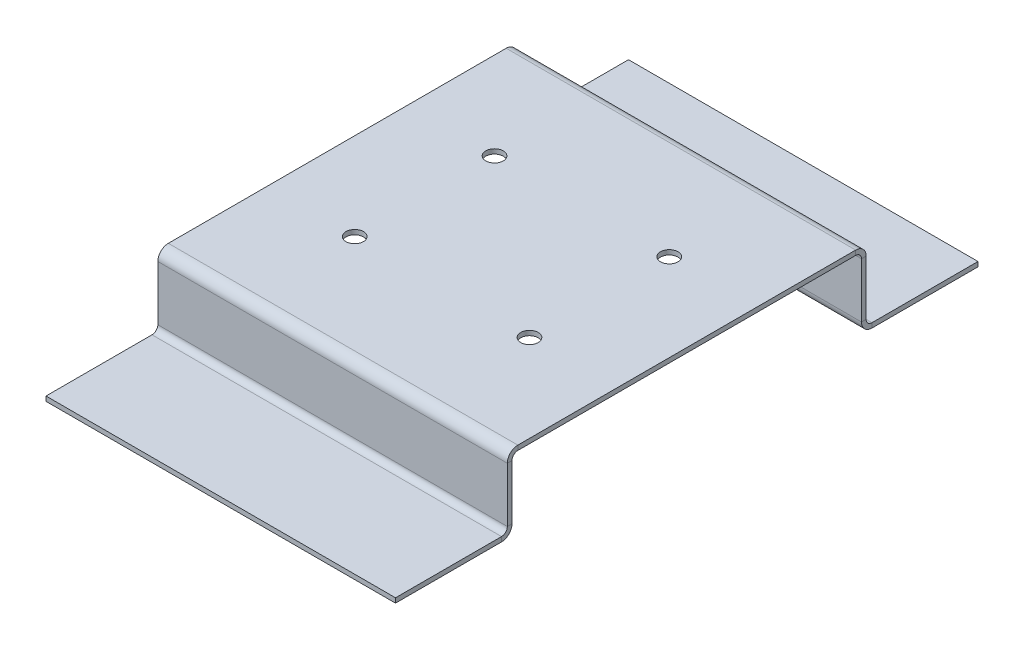
ISO-10303-21;
HEADER;
FILE_DESCRIPTION(('STEP AP214'),'2;1');
FILE_NAME('part.step','',(''),(''),'','','');
FILE_SCHEMA(('AUTOMOTIVE_DESIGN { 1 0 10303 214 1 1 1 1 }'));
ENDSEC;
DATA;
#1=APPLICATION_CONTEXT('core data for automotive mechanical design processes');
#2=APPLICATION_PROTOCOL_DEFINITION('international standard','automotive_design',2000,#1);
#3=PRODUCT_CONTEXT('',#1,'mechanical');
#4=PRODUCT('Part','Part','',(#3));
#5=PRODUCT_RELATED_PRODUCT_CATEGORY('part','',(#4));
#6=PRODUCT_DEFINITION_FORMATION('','',#4);
#7=PRODUCT_DEFINITION_CONTEXT('part definition',#1,'design');
#8=PRODUCT_DEFINITION('design','',#6,#7);
#9=PRODUCT_DEFINITION_SHAPE('','',#8);
#10=(LENGTH_UNIT() NAMED_UNIT(*) SI_UNIT(.MILLI.,.METRE.));
#11=(NAMED_UNIT(*) PLANE_ANGLE_UNIT() SI_UNIT($,.RADIAN.));
#12=(NAMED_UNIT(*) SI_UNIT($,.STERADIAN.) SOLID_ANGLE_UNIT());
#13=UNCERTAINTY_MEASURE_WITH_UNIT(LENGTH_MEASURE(1.E-05),#10,'distance_accuracy_value','');
#14=(GEOMETRIC_REPRESENTATION_CONTEXT(3) GLOBAL_UNCERTAINTY_ASSIGNED_CONTEXT((#13)) GLOBAL_UNIT_ASSIGNED_CONTEXT((#10,
#11,#12)) REPRESENTATION_CONTEXT('',''));
#15=CARTESIAN_POINT('',(0.,0.,0.));
#16=DIRECTION('',(0.,0.,1.));
#17=DIRECTION('',(1.,0.,0.));
#18=AXIS2_PLACEMENT_3D('',#15,#16,#17);
#19=CARTESIAN_POINT('',(-30.,-13.,-30.8));
#20=DIRECTION('',(-1.,0.,0.));
#21=DIRECTION('',(0.,-1.,0.));
#22=AXIS2_PLACEMENT_3D('',#19,#20,#21);
#23=PLANE('',#22);
#24=DIRECTION('',(0.,-1.,0.));
#25=VECTOR('',#24,1.);
#26=CARTESIAN_POINT('',(-30.,-13.,-30.8));
#27=LINE('',#26,#25);
#28=CARTESIAN_POINT('',(-30.,-1.8,-30.8));
#29=VERTEX_POINT('',#28);
#30=CARTESIAN_POINT('',(-30.,-11.2,-30.8));
#31=VERTEX_POINT('',#30);
#32=EDGE_CURVE('E389',#29,#31,#27,.T.);
#33=ORIENTED_EDGE('',*,*,#32,.T.);
#34=DIRECTION('',(0.,0.,1.));
#35=VECTOR('',#34,1.);
#36=CARTESIAN_POINT('',(-30.,-11.2,-30.8));
#37=LINE('',#36,#35);
#38=CARTESIAN_POINT('',(-30.,-11.2,-30.));
#39=VERTEX_POINT('',#38);
#40=EDGE_CURVE('E267',#31,#39,#37,.T.);
#41=ORIENTED_EDGE('',*,*,#40,.T.);
#42=DIRECTION('',(0.,-1.,0.));
#43=VECTOR('',#42,1.);
#44=CARTESIAN_POINT('',(-30.,-13.,-30.));
#45=LINE('',#44,#43);
#46=CARTESIAN_POINT('',(-30.,-1.8,-30.));
#47=VERTEX_POINT('',#46);
#48=EDGE_CURVE('E388',#47,#39,#45,.T.);
#49=ORIENTED_EDGE('',*,*,#48,.F.);
#50=DIRECTION('',(0.,0.,-1.));
#51=VECTOR('',#50,1.);
#52=CARTESIAN_POINT('',(-30.,-1.8,-30.));
#53=LINE('',#52,#51);
#54=EDGE_CURVE('E374',#47,#29,#53,.T.);
#55=ORIENTED_EDGE('',*,*,#54,.T.);
#56=EDGE_LOOP('',(#33,#41,#49,#55));
#57=FACE_BOUND('',#56,.T.);
#58=ADVANCED_FACE('F77',(#57),#23,.T.);
#59=CARTESIAN_POINT('',(0.,1.05170308243476E-13,-30.8));
#60=DIRECTION('',(0.,0.,-1.));
#61=DIRECTION('',(0.,1.,0.));
#62=AXIS2_PLACEMENT_3D('',#59,#60,#61);
#63=PLANE('',#62);
#64=DIRECTION('',(0.,1.,0.));
#65=VECTOR('',#64,1.);
#66=CARTESIAN_POINT('',(30.,-0.799999999999997,-30.8));
#67=LINE('',#66,#65);
#68=CARTESIAN_POINT('',(30.,-11.2,-30.8));
#69=VERTEX_POINT('',#68);
#70=CARTESIAN_POINT('',(30.,-1.79999999999999,-30.8));
#71=VERTEX_POINT('',#70);
#72=EDGE_CURVE('E391',#69,#71,#67,.T.);
#73=ORIENTED_EDGE('',*,*,#72,.F.);
#74=DIRECTION('',(-1.,0.,0.));
#75=VECTOR('',#74,1.);
#76=CARTESIAN_POINT('',(-30.,-11.2,-30.8));
#77=LINE('',#76,#75);
#78=EDGE_CURVE('E101',#31,#69,#77,.F.);
#79=ORIENTED_EDGE('',*,*,#78,.F.);
#80=ORIENTED_EDGE('',*,*,#32,.F.);
#81=DIRECTION('',(1.,0.,0.));
#82=VECTOR('',#81,1.);
#83=CARTESIAN_POINT('',(0.,-1.79999999999999,-30.8));
#84=LINE('',#83,#82);
#85=EDGE_CURVE('E383',#29,#71,#84,.T.);
#86=ORIENTED_EDGE('',*,*,#85,.T.);
#87=EDGE_LOOP('',(#73,#79,#80,#86));
#88=FACE_BOUND('',#87,.T.);
#89=ADVANCED_FACE('F510',(#88),#63,.T.);
#90=CARTESIAN_POINT('',(0.,1.02377123172402E-13,-30.));
#91=DIRECTION('',(0.,0.,-1.));
#92=DIRECTION('',(0.,1.,0.));
#93=AXIS2_PLACEMENT_3D('',#90,#91,#92);
#94=PLANE('',#93);
#95=DIRECTION('',(-1.,0.,0.));
#96=VECTOR('',#95,1.);
#97=CARTESIAN_POINT('',(-30.,-11.2,-30.));
#98=LINE('',#97,#96);
#99=CARTESIAN_POINT('',(30.,-11.2,-30.));
#100=VERTEX_POINT('',#99);
#101=EDGE_CURVE('E261',#39,#100,#98,.F.);
#102=ORIENTED_EDGE('',*,*,#101,.T.);
#103=DIRECTION('',(0.,1.,0.));
#104=VECTOR('',#103,1.);
#105=CARTESIAN_POINT('',(30.,-0.8,-30.));
#106=LINE('',#105,#104);
#107=CARTESIAN_POINT('',(30.,-1.8,-30.));
#108=VERTEX_POINT('',#107);
#109=EDGE_CURVE('E392',#100,#108,#106,.T.);
#110=ORIENTED_EDGE('',*,*,#109,.T.);
#111=DIRECTION('',(1.,0.,0.));
#112=VECTOR('',#111,1.);
#113=CARTESIAN_POINT('',(-30.,-1.8,-30.));
#114=LINE('',#113,#112);
#115=EDGE_CURVE('E377',#47,#108,#114,.T.);
#116=ORIENTED_EDGE('',*,*,#115,.F.);
#117=ORIENTED_EDGE('',*,*,#48,.T.);
#118=EDGE_LOOP('',(#102,#110,#116,#117));
#119=FACE_BOUND('',#118,.T.);
#120=ADVANCED_FACE('F475',(#119),#94,.F.);
#121=CARTESIAN_POINT('',(30.,-0.799999999999997,30.8));
#122=DIRECTION('',(1.,0.,0.));
#123=DIRECTION('',(0.,0.,-1.));
#124=AXIS2_PLACEMENT_3D('',#121,#122,#123);
#125=PLANE('',#124);
#126=DIRECTION('',(0.,-1.,0.));
#127=VECTOR('',#126,1.);
#128=CARTESIAN_POINT('',(30.,-0.799999999999997,30.8));
#129=LINE('',#128,#127);
#130=CARTESIAN_POINT('',(30.,-1.79999999999999,30.8));
#131=VERTEX_POINT('',#130);
#132=CARTESIAN_POINT('',(30.,-11.2,30.8));
#133=VERTEX_POINT('',#132);
#134=EDGE_CURVE('E344',#131,#133,#129,.T.);
#135=ORIENTED_EDGE('',*,*,#134,.T.);
#136=DIRECTION('',(0.,0.,-1.));
#137=VECTOR('',#136,1.);
#138=CARTESIAN_POINT('',(30.,-11.2,30.8));
#139=LINE('',#138,#137);
#140=CARTESIAN_POINT('',(30.,-11.2,30.));
#141=VERTEX_POINT('',#140);
#142=EDGE_CURVE('E317',#133,#141,#139,.T.);
#143=ORIENTED_EDGE('',*,*,#142,.T.);
#144=DIRECTION('',(0.,-1.,0.));
#145=VECTOR('',#144,1.);
#146=CARTESIAN_POINT('',(30.,-0.8,30.));
#147=LINE('',#146,#145);
#148=CARTESIAN_POINT('',(30.,-1.79999999999999,30.));
#149=VERTEX_POINT('',#148);
#150=EDGE_CURVE('E343',#149,#141,#147,.T.);
#151=ORIENTED_EDGE('',*,*,#150,.F.);
#152=DIRECTION('',(0.,0.,1.));
#153=VECTOR('',#152,1.);
#154=CARTESIAN_POINT('',(30.,-1.8,30.));
#155=LINE('',#154,#153);
#156=EDGE_CURVE('E330',#149,#131,#155,.T.);
#157=ORIENTED_EDGE('',*,*,#156,.T.);
#158=EDGE_LOOP('',(#135,#143,#151,#157));
#159=FACE_BOUND('',#158,.T.);
#160=ADVANCED_FACE('F452',(#159),#125,.T.);
#161=CARTESIAN_POINT('',(0.,1.05170308243476E-13,30.8));
#162=DIRECTION('',(0.,0.,-1.));
#163=DIRECTION('',(0.,1.,0.));
#164=AXIS2_PLACEMENT_3D('',#161,#162,#163);
#165=PLANE('',#164);
#166=DIRECTION('',(1.,0.,0.));
#167=VECTOR('',#166,1.);
#168=CARTESIAN_POINT('',(30.,-11.2,30.8));
#169=LINE('',#168,#167);
#170=CARTESIAN_POINT('',(-30.,-11.2,30.8));
#171=VERTEX_POINT('',#170);
#172=EDGE_CURVE('E323',#133,#171,#169,.F.);
#173=ORIENTED_EDGE('',*,*,#172,.F.);
#174=ORIENTED_EDGE('',*,*,#134,.F.);
#175=DIRECTION('',(1.,0.,0.));
#176=VECTOR('',#175,1.);
#177=CARTESIAN_POINT('',(0.,-1.8,30.8));
#178=LINE('',#177,#176);
#179=CARTESIAN_POINT('',(-30.,-1.8,30.8));
#180=VERTEX_POINT('',#179);
#181=EDGE_CURVE('E339',#180,#131,#178,.T.);
#182=ORIENTED_EDGE('',*,*,#181,.F.);
#183=DIRECTION('',(0.,1.,0.));
#184=VECTOR('',#183,1.);
#185=CARTESIAN_POINT('',(-30.,-13.,30.8));
#186=LINE('',#185,#184);
#187=EDGE_CURVE('E347',#171,#180,#186,.T.);
#188=ORIENTED_EDGE('',*,*,#187,.F.);
#189=EDGE_LOOP('',(#173,#174,#182,#188));
#190=FACE_BOUND('',#189,.T.);
#191=ADVANCED_FACE('F446',(#190),#165,.F.);
#192=CARTESIAN_POINT('',(0.,1.02377123172402E-13,30.));
#193=DIRECTION('',(0.,0.,-1.));
#194=DIRECTION('',(0.,1.,0.));
#195=AXIS2_PLACEMENT_3D('',#192,#193,#194);
#196=PLANE('',#195);
#197=ORIENTED_EDGE('',*,*,#150,.T.);
#198=DIRECTION('',(1.,0.,0.));
#199=VECTOR('',#198,1.);
#200=CARTESIAN_POINT('',(30.,-11.2,30.));
#201=LINE('',#200,#199);
#202=CARTESIAN_POINT('',(-30.,-11.2,30.));
#203=VERTEX_POINT('',#202);
#204=EDGE_CURVE('E310',#141,#203,#201,.F.);
#205=ORIENTED_EDGE('',*,*,#204,.T.);
#206=DIRECTION('',(0.,1.,0.));
#207=VECTOR('',#206,1.);
#208=CARTESIAN_POINT('',(-30.,-13.,30.));
#209=LINE('',#208,#207);
#210=CARTESIAN_POINT('',(-30.,-1.79999999999999,30.));
#211=VERTEX_POINT('',#210);
#212=EDGE_CURVE('E348',#203,#211,#209,.T.);
#213=ORIENTED_EDGE('',*,*,#212,.T.);
#214=DIRECTION('',(-1.,0.,0.));
#215=VECTOR('',#214,1.);
#216=CARTESIAN_POINT('',(30.,-1.8,30.));
#217=LINE('',#216,#215);
#218=EDGE_CURVE('E333',#149,#211,#217,.T.);
#219=ORIENTED_EDGE('',*,*,#218,.F.);
#220=EDGE_LOOP('',(#197,#205,#213,#219));
#221=FACE_BOUND('',#220,.T.);
#222=ADVANCED_FACE('F455',(#221),#196,.T.);
#223=CARTESIAN_POINT('',(0.,-0.8,0.));
#224=DIRECTION('',(0.,-1.,0.));
#225=DIRECTION('',(0.,0.,-1.));
#226=AXIS2_PLACEMENT_3D('',#223,#224,#225);
#227=PLANE('',#226);
#228=CARTESIAN_POINT('',(-15.,-0.8,12.));
#229=DIRECTION('',(0.,-1.,0.));
#230=DIRECTION('',(0.,0.,-1.));
#231=AXIS2_PLACEMENT_3D('',#228,#229,#230);
#232=CIRCLE('',#231,1.5);
#233=CARTESIAN_POINT('',(-15.,-0.8,10.5));
#234=VERTEX_POINT('',#233);
#235=EDGE_CURVE('E260',#234,#234,#232,.T.);
#236=ORIENTED_EDGE('',*,*,#235,.F.);
#237=EDGE_LOOP('',(#236));
#238=FACE_BOUND('',#237,.T.);
#239=CARTESIAN_POINT('',(15.,-0.8,12.));
#240=DIRECTION('',(0.,-1.,0.));
#241=DIRECTION('',(0.,0.,-1.));
#242=AXIS2_PLACEMENT_3D('',#239,#240,#241);
#243=CIRCLE('',#242,1.5);
#244=CARTESIAN_POINT('',(15.,-0.8,10.5));
#245=VERTEX_POINT('',#244);
#246=EDGE_CURVE('E972',#245,#245,#243,.T.);
#247=ORIENTED_EDGE('',*,*,#246,.F.);
#248=EDGE_LOOP('',(#247));
#249=FACE_BOUND('',#248,.T.);
#250=CARTESIAN_POINT('',(15.,-0.8,-12.));
#251=DIRECTION('',(0.,-1.,0.));
#252=DIRECTION('',(0.,0.,-1.));
#253=AXIS2_PLACEMENT_3D('',#250,#251,#252);
#254=CIRCLE('',#253,1.5);
#255=CARTESIAN_POINT('',(15.,-0.8,-13.5));
#256=VERTEX_POINT('',#255);
#257=EDGE_CURVE('E969',#256,#256,#254,.T.);
#258=ORIENTED_EDGE('',*,*,#257,.F.);
#259=EDGE_LOOP('',(#258));
#260=FACE_BOUND('',#259,.T.);
#261=CARTESIAN_POINT('',(-15.,-0.8,-12.));
#262=DIRECTION('',(0.,-1.,0.));
#263=DIRECTION('',(0.,0.,-1.));
#264=AXIS2_PLACEMENT_3D('',#261,#262,#263);
#265=CIRCLE('',#264,1.5);
#266=CARTESIAN_POINT('',(-15.,-0.8,-13.5));
#267=VERTEX_POINT('',#266);
#268=EDGE_CURVE('E966',#267,#267,#265,.T.);
#269=ORIENTED_EDGE('',*,*,#268,.F.);
#270=EDGE_LOOP('',(#269));
#271=FACE_BOUND('',#270,.T.);
#272=DIRECTION('',(0.,0.,-1.));
#273=VECTOR('',#272,1.);
#274=CARTESIAN_POINT('',(30.,-0.8,30.));
#275=LINE('',#274,#273);
#276=CARTESIAN_POINT('',(30.,-0.799999999999995,29.));
#277=VERTEX_POINT('',#276);
#278=CARTESIAN_POINT('',(30.,-0.8,-29.));
#279=VERTEX_POINT('',#278);
#280=EDGE_CURVE('E86',#277,#279,#275,.T.);
#281=ORIENTED_EDGE('',*,*,#280,.F.);
#282=DIRECTION('',(-1.,0.,0.));
#283=VECTOR('',#282,1.);
#284=CARTESIAN_POINT('',(-30.,-0.799999999999995,29.));
#285=LINE('',#284,#283);
#286=CARTESIAN_POINT('',(-30.,-0.799999999999995,29.));
#287=VERTEX_POINT('',#286);
#288=EDGE_CURVE('E366',#287,#277,#285,.F.);
#289=ORIENTED_EDGE('',*,*,#288,.F.);
#290=DIRECTION('',(0.,0.,1.));
#291=VECTOR('',#290,1.);
#292=CARTESIAN_POINT('',(-30.,-0.8,30.));
#293=LINE('',#292,#291);
#294=CARTESIAN_POINT('',(-30.,-0.8,-29.));
#295=VERTEX_POINT('',#294);
#296=EDGE_CURVE('E13',#295,#287,#293,.T.);
#297=ORIENTED_EDGE('',*,*,#296,.F.);
#298=DIRECTION('',(1.,0.,0.));
#299=VECTOR('',#298,1.);
#300=CARTESIAN_POINT('',(30.,-0.800000000000002,-29.));
#301=LINE('',#300,#299);
#302=EDGE_CURVE('E410',#279,#295,#301,.F.);
#303=ORIENTED_EDGE('',*,*,#302,.F.);
#304=EDGE_LOOP('',(#281,#289,#297,#303));
#305=FACE_BOUND('',#304,.T.);
#306=ADVANCED_FACE('F460',(#238,#249,#260,#271,#305),#227,.T.);
#307=CARTESIAN_POINT('',(0.,0.,0.));
#308=DIRECTION('',(0.,-1.,0.));
#309=DIRECTION('',(0.,0.,-1.));
#310=AXIS2_PLACEMENT_3D('',#307,#308,#309);
#311=PLANE('',#310);
#312=CARTESIAN_POINT('',(-15.,0.,12.));
#313=DIRECTION('',(0.,1.,0.));
#314=DIRECTION('',(0.,0.,1.));
#315=AXIS2_PLACEMENT_3D('',#312,#313,#314);
#316=CIRCLE('',#315,1.5);
#317=CARTESIAN_POINT('',(-15.,0.,13.5));
#318=VERTEX_POINT('',#317);
#319=EDGE_CURVE('E955',#318,#318,#316,.T.);
#320=ORIENTED_EDGE('',*,*,#319,.F.);
#321=EDGE_LOOP('',(#320));
#322=FACE_BOUND('',#321,.T.);
#323=CARTESIAN_POINT('',(15.,0.,12.));
#324=DIRECTION('',(0.,1.,0.));
#325=DIRECTION('',(0.,0.,1.));
#326=AXIS2_PLACEMENT_3D('',#323,#324,#325);
#327=CIRCLE('',#326,1.5);
#328=CARTESIAN_POINT('',(15.,0.,13.5));
#329=VERTEX_POINT('',#328);
#330=EDGE_CURVE('E956',#329,#329,#327,.T.);
#331=ORIENTED_EDGE('',*,*,#330,.F.);
#332=EDGE_LOOP('',(#331));
#333=FACE_BOUND('',#332,.T.);
#334=CARTESIAN_POINT('',(15.,0.,-12.));
#335=DIRECTION('',(0.,1.,0.));
#336=DIRECTION('',(0.,0.,1.));
#337=AXIS2_PLACEMENT_3D('',#334,#335,#336);
#338=CIRCLE('',#337,1.5);
#339=CARTESIAN_POINT('',(15.,0.,-10.5));
#340=VERTEX_POINT('',#339);
#341=EDGE_CURVE('E959',#340,#340,#338,.T.);
#342=ORIENTED_EDGE('',*,*,#341,.F.);
#343=EDGE_LOOP('',(#342));
#344=FACE_BOUND('',#343,.T.);
#345=CARTESIAN_POINT('',(-15.,0.,-12.));
#346=DIRECTION('',(0.,1.,0.));
#347=DIRECTION('',(0.,0.,1.));
#348=AXIS2_PLACEMENT_3D('',#345,#346,#347);
#349=CIRCLE('',#348,1.5);
#350=CARTESIAN_POINT('',(-15.,0.,-10.5));
#351=VERTEX_POINT('',#350);
#352=EDGE_CURVE('E963',#351,#351,#349,.T.);
#353=ORIENTED_EDGE('',*,*,#352,.F.);
#354=EDGE_LOOP('',(#353));
#355=FACE_BOUND('',#354,.T.);
#356=DIRECTION('',(-1.,0.,0.));
#357=VECTOR('',#356,1.);
#358=CARTESIAN_POINT('',(-30.,0.,29.));
#359=LINE('',#358,#357);
#360=CARTESIAN_POINT('',(-30.,0.,29.));
#361=VERTEX_POINT('',#360);
#362=CARTESIAN_POINT('',(30.,0.,29.));
#363=VERTEX_POINT('',#362);
#364=EDGE_CURVE('E354',#361,#363,#359,.F.);
#365=ORIENTED_EDGE('',*,*,#364,.T.);
#366=DIRECTION('',(0.,0.,-1.));
#367=VECTOR('',#366,1.);
#368=CARTESIAN_POINT('',(30.,0.,30.));
#369=LINE('',#368,#367);
#370=CARTESIAN_POINT('',(30.,0.,-29.));
#371=VERTEX_POINT('',#370);
#372=EDGE_CURVE('E418',#363,#371,#369,.T.);
#373=ORIENTED_EDGE('',*,*,#372,.T.);
#374=DIRECTION('',(1.,0.,0.));
#375=VECTOR('',#374,1.);
#376=CARTESIAN_POINT('',(30.,0.,-29.));
#377=LINE('',#376,#375);
#378=CARTESIAN_POINT('',(-30.,0.,-29.));
#379=VERTEX_POINT('',#378);
#380=EDGE_CURVE('E398',#371,#379,#377,.F.);
#381=ORIENTED_EDGE('',*,*,#380,.T.);
#382=DIRECTION('',(0.,0.,1.));
#383=VECTOR('',#382,1.);
#384=CARTESIAN_POINT('',(-30.,0.,30.));
#385=LINE('',#384,#383);
#386=EDGE_CURVE('E81',#379,#361,#385,.T.);
#387=ORIENTED_EDGE('',*,*,#386,.T.);
#388=EDGE_LOOP('',(#365,#373,#381,#387));
#389=FACE_BOUND('',#388,.T.);
#390=ADVANCED_FACE('F425',(#322,#333,#344,#355,#389),#311,.F.);
#391=CARTESIAN_POINT('',(-30.,-0.8,30.));
#392=DIRECTION('',(-1.,0.,0.));
#393=DIRECTION('',(0.,0.,1.));
#394=AXIS2_PLACEMENT_3D('',#391,#392,#393);
#395=PLANE('',#394);
#396=ORIENTED_EDGE('',*,*,#296,.T.);
#397=DIRECTION('',(0.,1.,0.));
#398=VECTOR('',#397,1.);
#399=CARTESIAN_POINT('',(-30.,-0.799999999999995,29.));
#400=LINE('',#399,#398);
#401=EDGE_CURVE('E360',#287,#361,#400,.T.);
#402=ORIENTED_EDGE('',*,*,#401,.T.);
#403=ORIENTED_EDGE('',*,*,#386,.F.);
#404=DIRECTION('',(0.,1.,0.));
#405=VECTOR('',#404,1.);
#406=CARTESIAN_POINT('',(-30.,-0.800000000000002,-29.));
#407=LINE('',#406,#405);
#408=EDGE_CURVE('E415',#295,#379,#407,.T.);
#409=ORIENTED_EDGE('',*,*,#408,.F.);
#410=EDGE_LOOP('',(#396,#402,#403,#409));
#411=FACE_BOUND('',#410,.T.);
#412=ADVANCED_FACE('F429',(#411),#395,.T.);
#413=CARTESIAN_POINT('',(30.,-0.8,30.));
#414=DIRECTION('',(1.,0.,0.));
#415=DIRECTION('',(0.,0.,-1.));
#416=AXIS2_PLACEMENT_3D('',#413,#414,#415);
#417=PLANE('',#416);
#418=DIRECTION('',(0.,1.,0.));
#419=VECTOR('',#418,1.);
#420=CARTESIAN_POINT('',(30.,-0.799999999999995,29.));
#421=LINE('',#420,#419);
#422=EDGE_CURVE('E371',#277,#363,#421,.T.);
#423=ORIENTED_EDGE('',*,*,#422,.F.);
#424=ORIENTED_EDGE('',*,*,#280,.T.);
#425=DIRECTION('',(0.,1.,0.));
#426=VECTOR('',#425,1.);
#427=CARTESIAN_POINT('',(30.,-0.800000000000002,-29.));
#428=LINE('',#427,#426);
#429=EDGE_CURVE('E404',#279,#371,#428,.T.);
#430=ORIENTED_EDGE('',*,*,#429,.T.);
#431=ORIENTED_EDGE('',*,*,#372,.F.);
#432=EDGE_LOOP('',(#423,#424,#430,#431));
#433=FACE_BOUND('',#432,.T.);
#434=ADVANCED_FACE('F79',(#433),#417,.T.);
#435=CARTESIAN_POINT('',(-30.,-1.8,-29.));
#436=DIRECTION('',(-1.,0.,0.));
#437=DIRECTION('',(0.,0.,1.));
#438=AXIS2_PLACEMENT_3D('',#435,#436,#437);
#439=PLANE('',#438);
#440=ORIENTED_EDGE('',*,*,#54,.F.);
#441=CARTESIAN_POINT('',(-30.,-1.8,-29.));
#442=DIRECTION('',(1.,0.,0.));
#443=DIRECTION('',(0.,0.,-1.));
#444=AXIS2_PLACEMENT_3D('',#441,#442,#443);
#445=CIRCLE('',#444,1.);
#446=EDGE_CURVE('E407',#295,#47,#445,.F.);
#447=ORIENTED_EDGE('',*,*,#446,.F.);
#448=ORIENTED_EDGE('',*,*,#408,.T.);
#449=CARTESIAN_POINT('',(-30.,-1.8,-29.));
#450=DIRECTION('',(1.,0.,0.));
#451=DIRECTION('',(0.,0.,-1.));
#452=AXIS2_PLACEMENT_3D('',#449,#450,#451);
#453=CIRCLE('',#452,1.8);
#454=EDGE_CURVE('E400',#379,#29,#453,.F.);
#455=ORIENTED_EDGE('',*,*,#454,.T.);
#456=EDGE_LOOP('',(#440,#447,#448,#455));
#457=FACE_BOUND('',#456,.T.);
#458=ADVANCED_FACE('F526',(#457),#439,.T.);
#459=CARTESIAN_POINT('',(30.,-1.8,-29.));
#460=DIRECTION('',(-1.,0.,0.));
#461=DIRECTION('',(0.,0.,1.));
#462=AXIS2_PLACEMENT_3D('',#459,#460,#461);
#463=PLANE('',#462);
#464=CARTESIAN_POINT('',(30.,-1.8,-29.));
#465=DIRECTION('',(1.,0.,0.));
#466=DIRECTION('',(0.,0.,-1.));
#467=AXIS2_PLACEMENT_3D('',#464,#465,#466);
#468=CIRCLE('',#467,1.);
#469=EDGE_CURVE('E394',#108,#279,#468,.T.);
#470=ORIENTED_EDGE('',*,*,#469,.F.);
#471=DIRECTION('',(0.,0.,-1.));
#472=VECTOR('',#471,1.);
#473=CARTESIAN_POINT('',(30.,-1.8,-30.));
#474=LINE('',#473,#472);
#475=EDGE_CURVE('E380',#108,#71,#474,.T.);
#476=ORIENTED_EDGE('',*,*,#475,.T.);
#477=CARTESIAN_POINT('',(30.,-1.8,-29.));
#478=DIRECTION('',(1.,0.,0.));
#479=DIRECTION('',(0.,0.,-1.));
#480=AXIS2_PLACEMENT_3D('',#477,#478,#479);
#481=CIRCLE('',#480,1.8);
#482=EDGE_CURVE('E401',#71,#371,#481,.T.);
#483=ORIENTED_EDGE('',*,*,#482,.T.);
#484=ORIENTED_EDGE('',*,*,#429,.F.);
#485=EDGE_LOOP('',(#470,#476,#483,#484));
#486=FACE_BOUND('',#485,.T.);
#487=ADVANCED_FACE('F466',(#486),#463,.F.);
#488=CARTESIAN_POINT('',(30.,-1.8,-29.));
#489=DIRECTION('',(1.,0.,0.));
#490=DIRECTION('',(0.,0.,-1.));
#491=AXIS2_PLACEMENT_3D('',#488,#489,#490);
#492=CYLINDRICAL_SURFACE('',#491,1.8);
#493=ORIENTED_EDGE('',*,*,#380,.F.);
#494=ORIENTED_EDGE('',*,*,#482,.F.);
#495=ORIENTED_EDGE('',*,*,#85,.F.);
#496=ORIENTED_EDGE('',*,*,#454,.F.);
#497=EDGE_LOOP('',(#493,#494,#495,#496));
#498=FACE_BOUND('',#497,.T.);
#499=ADVANCED_FACE('F520',(#498),#492,.T.);
#500=CARTESIAN_POINT('',(30.,-1.8,-29.));
#501=DIRECTION('',(1.,0.,0.));
#502=DIRECTION('',(0.,0.,-1.));
#503=AXIS2_PLACEMENT_3D('',#500,#501,#502);
#504=CYLINDRICAL_SURFACE('',#503,1.);
#505=ORIENTED_EDGE('',*,*,#302,.T.);
#506=ORIENTED_EDGE('',*,*,#446,.T.);
#507=ORIENTED_EDGE('',*,*,#115,.T.);
#508=ORIENTED_EDGE('',*,*,#469,.T.);
#509=EDGE_LOOP('',(#505,#506,#507,#508));
#510=FACE_BOUND('',#509,.T.);
#511=ADVANCED_FACE('F470',(#510),#504,.F.);
#512=CARTESIAN_POINT('',(30.,-0.799999999999997,-30.8));
#513=DIRECTION('',(1.,0.,0.));
#514=DIRECTION('',(0.,1.,0.));
#515=AXIS2_PLACEMENT_3D('',#512,#513,#514);
#516=PLANE('',#515);
#517=DIRECTION('',(0.,0.,1.));
#518=VECTOR('',#517,1.);
#519=CARTESIAN_POINT('',(30.,-11.2,-30.8));
#520=LINE('',#519,#518);
#521=EDGE_CURVE('E94',#69,#100,#520,.T.);
#522=ORIENTED_EDGE('',*,*,#521,.F.);
#523=ORIENTED_EDGE('',*,*,#72,.T.);
#524=ORIENTED_EDGE('',*,*,#475,.F.);
#525=ORIENTED_EDGE('',*,*,#109,.F.);
#526=EDGE_LOOP('',(#522,#523,#524,#525));
#527=FACE_BOUND('',#526,.T.);
#528=ADVANCED_FACE('F518',(#527),#516,.T.);
#529=CARTESIAN_POINT('',(30.,-1.8,29.));
#530=DIRECTION('',(1.,0.,0.));
#531=DIRECTION('',(0.,0.,-1.));
#532=AXIS2_PLACEMENT_3D('',#529,#530,#531);
#533=PLANE('',#532);
#534=ORIENTED_EDGE('',*,*,#156,.F.);
#535=CARTESIAN_POINT('',(30.,-1.8,29.));
#536=DIRECTION('',(-1.,0.,0.));
#537=DIRECTION('',(0.,0.,1.));
#538=AXIS2_PLACEMENT_3D('',#535,#536,#537);
#539=CIRCLE('',#538,1.);
#540=EDGE_CURVE('E363',#277,#149,#539,.F.);
#541=ORIENTED_EDGE('',*,*,#540,.F.);
#542=ORIENTED_EDGE('',*,*,#422,.T.);
#543=CARTESIAN_POINT('',(30.,-1.8,29.));
#544=DIRECTION('',(-1.,0.,0.));
#545=DIRECTION('',(0.,0.,1.));
#546=AXIS2_PLACEMENT_3D('',#543,#544,#545);
#547=CIRCLE('',#546,1.8);
#548=EDGE_CURVE('E356',#363,#131,#547,.F.);
#549=ORIENTED_EDGE('',*,*,#548,.T.);
#550=EDGE_LOOP('',(#534,#541,#542,#549));
#551=FACE_BOUND('',#550,.T.);
#552=ADVANCED_FACE('F448',(#551),#533,.T.);
#553=CARTESIAN_POINT('',(-30.,-1.8,29.));
#554=DIRECTION('',(1.,0.,0.));
#555=DIRECTION('',(0.,0.,-1.));
#556=AXIS2_PLACEMENT_3D('',#553,#554,#555);
#557=PLANE('',#556);
#558=CARTESIAN_POINT('',(-30.,-1.8,29.));
#559=DIRECTION('',(-1.,0.,0.));
#560=DIRECTION('',(0.,0.,1.));
#561=AXIS2_PLACEMENT_3D('',#558,#559,#560);
#562=CIRCLE('',#561,1.);
#563=EDGE_CURVE('E350',#211,#287,#562,.T.);
#564=ORIENTED_EDGE('',*,*,#563,.F.);
#565=DIRECTION('',(0.,0.,1.));
#566=VECTOR('',#565,1.);
#567=CARTESIAN_POINT('',(-30.,-1.8,30.));
#568=LINE('',#567,#566);
#569=EDGE_CURVE('E336',#211,#180,#568,.T.);
#570=ORIENTED_EDGE('',*,*,#569,.T.);
#571=CARTESIAN_POINT('',(-30.,-1.8,29.));
#572=DIRECTION('',(-1.,0.,0.));
#573=DIRECTION('',(0.,0.,1.));
#574=AXIS2_PLACEMENT_3D('',#571,#572,#573);
#575=CIRCLE('',#574,1.8);
#576=EDGE_CURVE('E357',#180,#361,#575,.T.);
#577=ORIENTED_EDGE('',*,*,#576,.T.);
#578=ORIENTED_EDGE('',*,*,#401,.F.);
#579=EDGE_LOOP('',(#564,#570,#577,#578));
#580=FACE_BOUND('',#579,.T.);
#581=ADVANCED_FACE('F437',(#580),#557,.F.);
#582=CARTESIAN_POINT('',(-30.,-1.8,29.));
#583=DIRECTION('',(-1.,0.,0.));
#584=DIRECTION('',(0.,0.,1.));
#585=AXIS2_PLACEMENT_3D('',#582,#583,#584);
#586=CYLINDRICAL_SURFACE('',#585,1.8);
#587=ORIENTED_EDGE('',*,*,#364,.F.);
#588=ORIENTED_EDGE('',*,*,#576,.F.);
#589=ORIENTED_EDGE('',*,*,#181,.T.);
#590=ORIENTED_EDGE('',*,*,#548,.F.);
#591=EDGE_LOOP('',(#587,#588,#589,#590));
#592=FACE_BOUND('',#591,.T.);
#593=ADVANCED_FACE('F436',(#592),#586,.T.);
#594=CARTESIAN_POINT('',(-30.,-1.8,29.));
#595=DIRECTION('',(-1.,0.,0.));
#596=DIRECTION('',(0.,0.,1.));
#597=AXIS2_PLACEMENT_3D('',#594,#595,#596);
#598=CYLINDRICAL_SURFACE('',#597,1.);
#599=ORIENTED_EDGE('',*,*,#288,.T.);
#600=ORIENTED_EDGE('',*,*,#540,.T.);
#601=ORIENTED_EDGE('',*,*,#218,.T.);
#602=ORIENTED_EDGE('',*,*,#563,.T.);
#603=EDGE_LOOP('',(#599,#600,#601,#602));
#604=FACE_BOUND('',#603,.T.);
#605=ADVANCED_FACE('F457',(#604),#598,.F.);
#606=CARTESIAN_POINT('',(-30.,-13.,30.8));
#607=DIRECTION('',(-1.,0.,0.));
#608=DIRECTION('',(0.,0.,1.));
#609=AXIS2_PLACEMENT_3D('',#606,#607,#608);
#610=PLANE('',#609);
#611=DIRECTION('',(0.,0.,-1.));
#612=VECTOR('',#611,1.);
#613=CARTESIAN_POINT('',(-30.,-11.2,30.8));
#614=LINE('',#613,#612);
#615=EDGE_CURVE('E327',#171,#203,#614,.T.);
#616=ORIENTED_EDGE('',*,*,#615,.F.);
#617=ORIENTED_EDGE('',*,*,#187,.T.);
#618=ORIENTED_EDGE('',*,*,#569,.F.);
#619=ORIENTED_EDGE('',*,*,#212,.F.);
#620=EDGE_LOOP('',(#616,#617,#618,#619));
#621=FACE_BOUND('',#620,.T.);
#622=ADVANCED_FACE('F590',(#621),#610,.T.);
#623=CARTESIAN_POINT('',(-30.,-11.2,31.8));
#624=DIRECTION('',(-1.,0.,0.));
#625=DIRECTION('',(0.,0.,1.));
#626=AXIS2_PLACEMENT_3D('',#623,#624,#625);
#627=PLANE('',#626);
#628=DIRECTION('',(0.,1.,0.));
#629=VECTOR('',#628,1.);
#630=CARTESIAN_POINT('',(-30.,-13.,31.8));
#631=LINE('',#630,#629);
#632=CARTESIAN_POINT('',(-30.,-12.2,31.8));
#633=VERTEX_POINT('',#632);
#634=CARTESIAN_POINT('',(-30.,-13.,31.8));
#635=VERTEX_POINT('',#634);
#636=EDGE_CURVE('E278',#633,#635,#631,.F.);
#637=ORIENTED_EDGE('',*,*,#636,.F.);
#638=CARTESIAN_POINT('',(-30.,-11.2,31.8));
#639=DIRECTION('',(1.,0.,0.));
#640=DIRECTION('',(0.,0.,-1.));
#641=AXIS2_PLACEMENT_3D('',#638,#639,#640);
#642=CIRCLE('',#641,1.);
#643=EDGE_CURVE('E320',#171,#633,#642,.F.);
#644=ORIENTED_EDGE('',*,*,#643,.F.);
#645=ORIENTED_EDGE('',*,*,#615,.T.);
#646=CARTESIAN_POINT('',(-30.,-11.2,31.8));
#647=DIRECTION('',(1.,0.,0.));
#648=DIRECTION('',(0.,0.,-1.));
#649=AXIS2_PLACEMENT_3D('',#646,#647,#648);
#650=CIRCLE('',#649,1.8);
#651=EDGE_CURVE('E313',#203,#635,#650,.F.);
#652=ORIENTED_EDGE('',*,*,#651,.T.);
#653=EDGE_LOOP('',(#637,#644,#645,#652));
#654=FACE_BOUND('',#653,.T.);
#655=ADVANCED_FACE('F596',(#654),#627,.T.);
#656=CARTESIAN_POINT('',(30.,-11.2,31.8));
#657=DIRECTION('',(-1.,0.,0.));
#658=DIRECTION('',(0.,0.,1.));
#659=AXIS2_PLACEMENT_3D('',#656,#657,#658);
#660=PLANE('',#659);
#661=CARTESIAN_POINT('',(30.,-11.2,31.8));
#662=DIRECTION('',(1.,0.,0.));
#663=DIRECTION('',(0.,0.,-1.));
#664=AXIS2_PLACEMENT_3D('',#661,#662,#663);
#665=CIRCLE('',#664,1.);
#666=CARTESIAN_POINT('',(30.,-12.2,31.8));
#667=VERTEX_POINT('',#666);
#668=EDGE_CURVE('E283',#667,#133,#665,.T.);
#669=ORIENTED_EDGE('',*,*,#668,.F.);
#670=DIRECTION('',(0.,1.,0.));
#671=VECTOR('',#670,1.);
#672=CARTESIAN_POINT('',(30.,-12.2,31.8));
#673=LINE('',#672,#671);
#674=CARTESIAN_POINT('',(30.,-13.,31.8));
#675=VERTEX_POINT('',#674);
#676=EDGE_CURVE('E303',#667,#675,#673,.F.);
#677=ORIENTED_EDGE('',*,*,#676,.T.);
#678=CARTESIAN_POINT('',(30.,-11.2,31.8));
#679=DIRECTION('',(1.,0.,0.));
#680=DIRECTION('',(0.,0.,-1.));
#681=AXIS2_PLACEMENT_3D('',#678,#679,#680);
#682=CIRCLE('',#681,1.8);
#683=EDGE_CURVE('E314',#675,#141,#682,.T.);
#684=ORIENTED_EDGE('',*,*,#683,.T.);
#685=ORIENTED_EDGE('',*,*,#142,.F.);
#686=EDGE_LOOP('',(#669,#677,#684,#685));
#687=FACE_BOUND('',#686,.T.);
#688=ADVANCED_FACE('F603',(#687),#660,.F.);
#689=CARTESIAN_POINT('',(30.,-11.2,31.8));
#690=DIRECTION('',(1.,0.,0.));
#691=DIRECTION('',(0.,-1.,0.));
#692=AXIS2_PLACEMENT_3D('',#689,#690,#691);
#693=CYLINDRICAL_SURFACE('',#692,1.8);
#694=ORIENTED_EDGE('',*,*,#204,.F.);
#695=ORIENTED_EDGE('',*,*,#683,.F.);
#696=DIRECTION('',(1.,0.,0.));
#697=VECTOR('',#696,1.);
#698=CARTESIAN_POINT('',(-30.,-13.,31.8));
#699=LINE('',#698,#697);
#700=EDGE_CURVE('E301',#675,#635,#699,.F.);
#701=ORIENTED_EDGE('',*,*,#700,.T.);
#702=ORIENTED_EDGE('',*,*,#651,.F.);
#703=EDGE_LOOP('',(#694,#695,#701,#702));
#704=FACE_BOUND('',#703,.T.);
#705=ADVANCED_FACE('F611',(#704),#693,.T.);
#706=CARTESIAN_POINT('',(30.,-11.2,31.8));
#707=DIRECTION('',(1.,0.,0.));
#708=DIRECTION('',(0.,-1.,0.));
#709=AXIS2_PLACEMENT_3D('',#706,#707,#708);
#710=CYLINDRICAL_SURFACE('',#709,1.);
#711=ORIENTED_EDGE('',*,*,#172,.T.);
#712=ORIENTED_EDGE('',*,*,#643,.T.);
#713=DIRECTION('',(1.,0.,0.));
#714=VECTOR('',#713,1.);
#715=CARTESIAN_POINT('',(-30.,-12.2,31.8));
#716=LINE('',#715,#714);
#717=EDGE_CURVE('E306',#633,#667,#716,.T.);
#718=ORIENTED_EDGE('',*,*,#717,.T.);
#719=ORIENTED_EDGE('',*,*,#668,.T.);
#720=EDGE_LOOP('',(#711,#712,#718,#719));
#721=FACE_BOUND('',#720,.T.);
#722=ADVANCED_FACE('F619',(#721),#710,.F.);
#723=CARTESIAN_POINT('',(30.,-13.,50.));
#724=DIRECTION('',(-1.,0.,0.));
#725=DIRECTION('',(0.,0.,1.));
#726=AXIS2_PLACEMENT_3D('',#723,#724,#725);
#727=PLANE('',#726);
#728=ORIENTED_EDGE('',*,*,#676,.F.);
#729=DIRECTION('',(0.,0.,-1.));
#730=VECTOR('',#729,1.);
#731=CARTESIAN_POINT('',(30.,-12.2,50.));
#732=LINE('',#731,#730);
#733=CARTESIAN_POINT('',(30.,-12.2,50.));
#734=VERTEX_POINT('',#733);
#735=EDGE_CURVE('E299',#667,#734,#732,.F.);
#736=ORIENTED_EDGE('',*,*,#735,.T.);
#737=DIRECTION('',(0.,1.,0.));
#738=VECTOR('',#737,1.);
#739=CARTESIAN_POINT('',(30.,-13.,50.));
#740=LINE('',#739,#738);
#741=CARTESIAN_POINT('',(30.,-13.,50.));
#742=VERTEX_POINT('',#741);
#743=EDGE_CURVE('E280',#742,#734,#740,.T.);
#744=ORIENTED_EDGE('',*,*,#743,.F.);
#745=DIRECTION('',(0.,0.,1.));
#746=VECTOR('',#745,1.);
#747=CARTESIAN_POINT('',(30.,-13.,0.));
#748=LINE('',#747,#746);
#749=EDGE_CURVE('E292',#675,#742,#748,.T.);
#750=ORIENTED_EDGE('',*,*,#749,.F.);
#751=EDGE_LOOP('',(#728,#736,#744,#750));
#752=FACE_BOUND('',#751,.T.);
#753=ADVANCED_FACE('F627',(#752),#727,.F.);
#754=CARTESIAN_POINT('',(-30.,-13.,30.8));
#755=DIRECTION('',(1.,0.,0.));
#756=DIRECTION('',(0.,0.,-1.));
#757=AXIS2_PLACEMENT_3D('',#754,#755,#756);
#758=PLANE('',#757);
#759=ORIENTED_EDGE('',*,*,#636,.T.);
#760=DIRECTION('',(0.,0.,-1.));
#761=VECTOR('',#760,1.);
#762=CARTESIAN_POINT('',(-30.,-13.,0.));
#763=LINE('',#762,#761);
#764=CARTESIAN_POINT('',(-30.,-13.,50.));
#765=VERTEX_POINT('',#764);
#766=EDGE_CURVE('E287',#765,#635,#763,.T.);
#767=ORIENTED_EDGE('',*,*,#766,.F.);
#768=DIRECTION('',(0.,1.,0.));
#769=VECTOR('',#768,1.);
#770=CARTESIAN_POINT('',(-30.,-13.,50.));
#771=LINE('',#770,#769);
#772=CARTESIAN_POINT('',(-30.,-12.2,50.));
#773=VERTEX_POINT('',#772);
#774=EDGE_CURVE('E284',#765,#773,#771,.T.);
#775=ORIENTED_EDGE('',*,*,#774,.T.);
#776=DIRECTION('',(0.,0.,1.));
#777=VECTOR('',#776,1.);
#778=CARTESIAN_POINT('',(-30.,-12.2,30.8));
#779=LINE('',#778,#777);
#780=EDGE_CURVE('E294',#773,#633,#779,.F.);
#781=ORIENTED_EDGE('',*,*,#780,.T.);
#782=EDGE_LOOP('',(#759,#767,#775,#781));
#783=FACE_BOUND('',#782,.T.);
#784=ADVANCED_FACE('F635',(#783),#758,.F.);
#785=CARTESIAN_POINT('',(0.,-13.,0.));
#786=DIRECTION('',(0.,1.,0.));
#787=DIRECTION('',(0.,0.,1.));
#788=AXIS2_PLACEMENT_3D('',#785,#786,#787);
#789=PLANE('',#788);
#790=ORIENTED_EDGE('',*,*,#700,.F.);
#791=ORIENTED_EDGE('',*,*,#749,.T.);
#792=DIRECTION('',(-1.,0.,0.));
#793=VECTOR('',#792,1.);
#794=CARTESIAN_POINT('',(0.,-13.,50.));
#795=LINE('',#794,#793);
#796=EDGE_CURVE('E290',#742,#765,#795,.T.);
#797=ORIENTED_EDGE('',*,*,#796,.T.);
#798=ORIENTED_EDGE('',*,*,#766,.T.);
#799=EDGE_LOOP('',(#790,#791,#797,#798));
#800=FACE_BOUND('',#799,.T.);
#801=ADVANCED_FACE('F643',(#800),#789,.F.);
#802=CARTESIAN_POINT('',(0.,-12.2,0.));
#803=DIRECTION('',(0.,1.,0.));
#804=DIRECTION('',(0.,0.,1.));
#805=AXIS2_PLACEMENT_3D('',#802,#803,#804);
#806=PLANE('',#805);
#807=ORIENTED_EDGE('',*,*,#735,.F.);
#808=ORIENTED_EDGE('',*,*,#717,.F.);
#809=ORIENTED_EDGE('',*,*,#780,.F.);
#810=DIRECTION('',(1.,0.,0.));
#811=VECTOR('',#810,1.);
#812=CARTESIAN_POINT('',(-30.,-12.2,50.));
#813=LINE('',#812,#811);
#814=EDGE_CURVE('E297',#734,#773,#813,.F.);
#815=ORIENTED_EDGE('',*,*,#814,.F.);
#816=EDGE_LOOP('',(#807,#808,#809,#815));
#817=FACE_BOUND('',#816,.T.);
#818=ADVANCED_FACE('F505',(#817),#806,.T.);
#819=CARTESIAN_POINT('',(-30.,-13.,50.));
#820=DIRECTION('',(0.,0.,-1.));
#821=DIRECTION('',(0.,1.,0.));
#822=AXIS2_PLACEMENT_3D('',#819,#820,#821);
#823=PLANE('',#822);
#824=ORIENTED_EDGE('',*,*,#814,.T.);
#825=ORIENTED_EDGE('',*,*,#774,.F.);
#826=ORIENTED_EDGE('',*,*,#796,.F.);
#827=ORIENTED_EDGE('',*,*,#743,.T.);
#828=EDGE_LOOP('',(#824,#825,#826,#827));
#829=FACE_BOUND('',#828,.T.);
#830=ADVANCED_FACE('F498',(#829),#823,.F.);
#831=CARTESIAN_POINT('',(30.,-11.2,-31.8));
#832=DIRECTION('',(1.,0.,0.));
#833=DIRECTION('',(0.,0.,-1.));
#834=AXIS2_PLACEMENT_3D('',#831,#832,#833);
#835=PLANE('',#834);
#836=DIRECTION('',(0.,1.,0.));
#837=VECTOR('',#836,1.);
#838=CARTESIAN_POINT('',(30.,-13.,-31.8));
#839=LINE('',#838,#837);
#840=CARTESIAN_POINT('',(30.,-12.2,-31.8));
#841=VERTEX_POINT('',#840);
#842=CARTESIAN_POINT('',(30.,-13.,-31.8));
#843=VERTEX_POINT('',#842);
#844=EDGE_CURVE('E242',#841,#843,#839,.F.);
#845=ORIENTED_EDGE('',*,*,#844,.F.);
#846=CARTESIAN_POINT('',(30.,-11.2,-31.8));
#847=DIRECTION('',(-1.,0.,0.));
#848=DIRECTION('',(0.,0.,1.));
#849=AXIS2_PLACEMENT_3D('',#846,#847,#848);
#850=CIRCLE('',#849,1.);
#851=EDGE_CURVE('E270',#69,#841,#850,.F.);
#852=ORIENTED_EDGE('',*,*,#851,.F.);
#853=ORIENTED_EDGE('',*,*,#521,.T.);
#854=CARTESIAN_POINT('',(30.,-11.2,-31.8));
#855=DIRECTION('',(-1.,0.,0.));
#856=DIRECTION('',(0.,0.,1.));
#857=AXIS2_PLACEMENT_3D('',#854,#855,#856);
#858=CIRCLE('',#857,1.8);
#859=EDGE_CURVE('E263',#100,#843,#858,.F.);
#860=ORIENTED_EDGE('',*,*,#859,.T.);
#861=EDGE_LOOP('',(#845,#852,#853,#860));
#862=FACE_BOUND('',#861,.T.);
#863=ADVANCED_FACE('F496',(#862),#835,.T.);
#864=CARTESIAN_POINT('',(-30.,-11.2,-31.8));
#865=DIRECTION('',(1.,0.,0.));
#866=DIRECTION('',(0.,0.,-1.));
#867=AXIS2_PLACEMENT_3D('',#864,#865,#866);
#868=PLANE('',#867);
#869=CARTESIAN_POINT('',(-30.,-11.2,-31.8));
#870=DIRECTION('',(-1.,0.,0.));
#871=DIRECTION('',(0.,0.,1.));
#872=AXIS2_PLACEMENT_3D('',#869,#870,#871);
#873=CIRCLE('',#872,1.);
#874=CARTESIAN_POINT('',(-30.,-12.2,-31.8));
#875=VERTEX_POINT('',#874);
#876=EDGE_CURVE('E274',#875,#31,#873,.T.);
#877=ORIENTED_EDGE('',*,*,#876,.F.);
#878=DIRECTION('',(0.,1.,0.));
#879=VECTOR('',#878,1.);
#880=CARTESIAN_POINT('',(-30.,-12.2,-31.8));
#881=LINE('',#880,#879);
#882=CARTESIAN_POINT('',(-30.,-13.,-31.8));
#883=VERTEX_POINT('',#882);
#884=EDGE_CURVE('E254',#875,#883,#881,.F.);
#885=ORIENTED_EDGE('',*,*,#884,.T.);
#886=CARTESIAN_POINT('',(-30.,-11.2,-31.8));
#887=DIRECTION('',(-1.,0.,0.));
#888=DIRECTION('',(0.,0.,1.));
#889=AXIS2_PLACEMENT_3D('',#886,#887,#888);
#890=CIRCLE('',#889,1.8);
#891=EDGE_CURVE('E264',#883,#39,#890,.T.);
#892=ORIENTED_EDGE('',*,*,#891,.T.);
#893=ORIENTED_EDGE('',*,*,#40,.F.);
#894=EDGE_LOOP('',(#877,#885,#892,#893));
#895=FACE_BOUND('',#894,.T.);
#896=ADVANCED_FACE('F481',(#895),#868,.F.);
#897=CARTESIAN_POINT('',(-30.,-11.2,-31.8));
#898=DIRECTION('',(-1.,0.,0.));
#899=DIRECTION('',(0.,-1.,0.));
#900=AXIS2_PLACEMENT_3D('',#897,#898,#899);
#901=CYLINDRICAL_SURFACE('',#900,1.8);
#902=ORIENTED_EDGE('',*,*,#101,.F.);
#903=ORIENTED_EDGE('',*,*,#891,.F.);
#904=DIRECTION('',(-1.,0.,0.));
#905=VECTOR('',#904,1.);
#906=CARTESIAN_POINT('',(30.,-13.,-31.8));
#907=LINE('',#906,#905);
#908=EDGE_CURVE('E252',#883,#843,#907,.F.);
#909=ORIENTED_EDGE('',*,*,#908,.T.);
#910=ORIENTED_EDGE('',*,*,#859,.F.);
#911=EDGE_LOOP('',(#902,#903,#909,#910));
#912=FACE_BOUND('',#911,.T.);
#913=ADVANCED_FACE('F494',(#912),#901,.T.);
#914=CARTESIAN_POINT('',(-30.,-11.2,-31.8));
#915=DIRECTION('',(-1.,0.,0.));
#916=DIRECTION('',(0.,-1.,0.));
#917=AXIS2_PLACEMENT_3D('',#914,#915,#916);
#918=CYLINDRICAL_SURFACE('',#917,1.);
#919=ORIENTED_EDGE('',*,*,#78,.T.);
#920=ORIENTED_EDGE('',*,*,#851,.T.);
#921=DIRECTION('',(-1.,0.,0.));
#922=VECTOR('',#921,1.);
#923=CARTESIAN_POINT('',(30.,-12.2,-31.8));
#924=LINE('',#923,#922);
#925=EDGE_CURVE('E257',#841,#875,#924,.T.);
#926=ORIENTED_EDGE('',*,*,#925,.T.);
#927=ORIENTED_EDGE('',*,*,#876,.T.);
#928=EDGE_LOOP('',(#919,#920,#926,#927));
#929=FACE_BOUND('',#928,.T.);
#930=ADVANCED_FACE('F484',(#929),#918,.F.);
#931=CARTESIAN_POINT('',(-30.,-13.,-50.));
#932=DIRECTION('',(1.,0.,0.));
#933=DIRECTION('',(0.,0.,-1.));
#934=AXIS2_PLACEMENT_3D('',#931,#932,#933);
#935=PLANE('',#934);
#936=ORIENTED_EDGE('',*,*,#884,.F.);
#937=DIRECTION('',(0.,0.,1.));
#938=VECTOR('',#937,1.);
#939=CARTESIAN_POINT('',(-30.,-12.2,-50.));
#940=LINE('',#939,#938);
#941=CARTESIAN_POINT('',(-30.,-12.2,-50.));
#942=VERTEX_POINT('',#941);
#943=EDGE_CURVE('E250',#875,#942,#940,.F.);
#944=ORIENTED_EDGE('',*,*,#943,.T.);
#945=DIRECTION('',(0.,1.,0.));
#946=VECTOR('',#945,1.);
#947=CARTESIAN_POINT('',(-30.,-13.,-50.));
#948=LINE('',#947,#946);
#949=CARTESIAN_POINT('',(-30.,-13.,-50.));
#950=VERTEX_POINT('',#949);
#951=EDGE_CURVE('E238',#950,#942,#948,.T.);
#952=ORIENTED_EDGE('',*,*,#951,.F.);
#953=DIRECTION('',(0.,0.,-1.));
#954=VECTOR('',#953,1.);
#955=CARTESIAN_POINT('',(-30.,-13.,0.));
#956=LINE('',#955,#954);
#957=EDGE_CURVE('E225',#883,#950,#956,.T.);
#958=ORIENTED_EDGE('',*,*,#957,.F.);
#959=EDGE_LOOP('',(#936,#944,#952,#958));
#960=FACE_BOUND('',#959,.T.);
#961=ADVANCED_FACE('F491',(#960),#935,.F.);
#962=CARTESIAN_POINT('',(30.,-13.,-30.8));
#963=DIRECTION('',(-1.,0.,0.));
#964=DIRECTION('',(0.,0.,1.));
#965=AXIS2_PLACEMENT_3D('',#962,#963,#964);
#966=PLANE('',#965);
#967=ORIENTED_EDGE('',*,*,#844,.T.);
#968=DIRECTION('',(0.,0.,1.));
#969=VECTOR('',#968,1.);
#970=CARTESIAN_POINT('',(30.,-13.,0.));
#971=LINE('',#970,#969);
#972=CARTESIAN_POINT('',(30.,-13.,-50.));
#973=VERTEX_POINT('',#972);
#974=EDGE_CURVE('E223',#973,#843,#971,.T.);
#975=ORIENTED_EDGE('',*,*,#974,.F.);
#976=DIRECTION('',(0.,1.,0.));
#977=VECTOR('',#976,1.);
#978=CARTESIAN_POINT('',(30.,-13.,-50.));
#979=LINE('',#978,#977);
#980=CARTESIAN_POINT('',(30.,-12.2,-50.));
#981=VERTEX_POINT('',#980);
#982=EDGE_CURVE('E231',#973,#981,#979,.T.);
#983=ORIENTED_EDGE('',*,*,#982,.T.);
#984=DIRECTION('',(0.,0.,-1.));
#985=VECTOR('',#984,1.);
#986=CARTESIAN_POINT('',(30.,-12.2,-30.8));
#987=LINE('',#986,#985);
#988=EDGE_CURVE('E247',#981,#841,#987,.F.);
#989=ORIENTED_EDGE('',*,*,#988,.T.);
#990=EDGE_LOOP('',(#967,#975,#983,#989));
#991=FACE_BOUND('',#990,.T.);
#992=ADVANCED_FACE('F241',(#991),#966,.F.);
#993=CARTESIAN_POINT('',(0.,-13.,0.));
#994=DIRECTION('',(0.,1.,0.));
#995=DIRECTION('',(0.,0.,1.));
#996=AXIS2_PLACEMENT_3D('',#993,#994,#995);
#997=PLANE('',#996);
#998=ORIENTED_EDGE('',*,*,#908,.F.);
#999=ORIENTED_EDGE('',*,*,#957,.T.);
#1000=DIRECTION('',(1.,0.,0.));
#1001=VECTOR('',#1000,1.);
#1002=CARTESIAN_POINT('',(0.,-13.,-50.));
#1003=LINE('',#1002,#1001);
#1004=EDGE_CURVE('E218',#950,#973,#1003,.T.);
#1005=ORIENTED_EDGE('',*,*,#1004,.T.);
#1006=ORIENTED_EDGE('',*,*,#974,.T.);
#1007=EDGE_LOOP('',(#998,#999,#1005,#1006));
#1008=FACE_BOUND('',#1007,.T.);
#1009=ADVANCED_FACE('F221',(#1008),#997,.F.);
#1010=CARTESIAN_POINT('',(0.,-12.2,0.));
#1011=DIRECTION('',(0.,1.,0.));
#1012=DIRECTION('',(0.,0.,1.));
#1013=AXIS2_PLACEMENT_3D('',#1010,#1011,#1012);
#1014=PLANE('',#1013);
#1015=ORIENTED_EDGE('',*,*,#943,.F.);
#1016=ORIENTED_EDGE('',*,*,#925,.F.);
#1017=ORIENTED_EDGE('',*,*,#988,.F.);
#1018=DIRECTION('',(-1.,0.,0.));
#1019=VECTOR('',#1018,1.);
#1020=CARTESIAN_POINT('',(30.,-12.2,-50.));
#1021=LINE('',#1020,#1019);
#1022=EDGE_CURVE('E234',#942,#981,#1021,.F.);
#1023=ORIENTED_EDGE('',*,*,#1022,.F.);
#1024=EDGE_LOOP('',(#1015,#1016,#1017,#1023));
#1025=FACE_BOUND('',#1024,.T.);
#1026=ADVANCED_FACE('F489',(#1025),#1014,.T.);
#1027=CARTESIAN_POINT('',(30.,-13.,-50.));
#1028=DIRECTION('',(0.,0.,1.));
#1029=DIRECTION('',(0.,-1.,0.));
#1030=AXIS2_PLACEMENT_3D('',#1027,#1028,#1029);
#1031=PLANE('',#1030);
#1032=ORIENTED_EDGE('',*,*,#1022,.T.);
#1033=ORIENTED_EDGE('',*,*,#982,.F.);
#1034=ORIENTED_EDGE('',*,*,#1004,.F.);
#1035=ORIENTED_EDGE('',*,*,#951,.T.);
#1036=EDGE_LOOP('',(#1032,#1033,#1034,#1035));
#1037=FACE_BOUND('',#1036,.T.);
#1038=ADVANCED_FACE('F232',(#1037),#1031,.F.);
#1039=CARTESIAN_POINT('',(-15.,-13.,-12.));
#1040=DIRECTION('',(0.,1.,0.));
#1041=DIRECTION('',(0.,0.,1.));
#1042=AXIS2_PLACEMENT_3D('',#1039,#1040,#1041);
#1043=CYLINDRICAL_SURFACE('',#1042,1.5);
#1044=ORIENTED_EDGE('',*,*,#268,.T.);
#1045=EDGE_LOOP('',(#1044));
#1046=FACE_BOUND('',#1045,.T.);
#1047=ORIENTED_EDGE('',*,*,#352,.T.);
#1048=EDGE_LOOP('',(#1047));
#1049=FACE_BOUND('',#1048,.T.);
#1050=ADVANCED_FACE('F738',(#1046,#1049),#1043,.F.);
#1051=CARTESIAN_POINT('',(15.,-13.,-12.));
#1052=DIRECTION('',(0.,1.,0.));
#1053=DIRECTION('',(0.,0.,1.));
#1054=AXIS2_PLACEMENT_3D('',#1051,#1052,#1053);
#1055=CYLINDRICAL_SURFACE('',#1054,1.5);
#1056=ORIENTED_EDGE('',*,*,#257,.T.);
#1057=EDGE_LOOP('',(#1056));
#1058=FACE_BOUND('',#1057,.T.);
#1059=ORIENTED_EDGE('',*,*,#341,.T.);
#1060=EDGE_LOOP('',(#1059));
#1061=FACE_BOUND('',#1060,.T.);
#1062=ADVANCED_FACE('F764',(#1058,#1061),#1055,.F.);
#1063=CARTESIAN_POINT('',(15.,-13.,12.));
#1064=DIRECTION('',(0.,1.,0.));
#1065=DIRECTION('',(0.,0.,1.));
#1066=AXIS2_PLACEMENT_3D('',#1063,#1064,#1065);
#1067=CYLINDRICAL_SURFACE('',#1066,1.5);
#1068=ORIENTED_EDGE('',*,*,#246,.T.);
#1069=EDGE_LOOP('',(#1068));
#1070=FACE_BOUND('',#1069,.T.);
#1071=ORIENTED_EDGE('',*,*,#330,.T.);
#1072=EDGE_LOOP('',(#1071));
#1073=FACE_BOUND('',#1072,.T.);
#1074=ADVANCED_FACE('F775',(#1070,#1073),#1067,.F.);
#1075=CARTESIAN_POINT('',(-15.,-13.,12.));
#1076=DIRECTION('',(0.,1.,0.));
#1077=DIRECTION('',(0.,0.,1.));
#1078=AXIS2_PLACEMENT_3D('',#1075,#1076,#1077);
#1079=CYLINDRICAL_SURFACE('',#1078,1.5);
#1080=ORIENTED_EDGE('',*,*,#235,.T.);
#1081=EDGE_LOOP('',(#1080));
#1082=FACE_BOUND('',#1081,.T.);
#1083=ORIENTED_EDGE('',*,*,#319,.T.);
#1084=EDGE_LOOP('',(#1083));
#1085=FACE_BOUND('',#1084,.T.);
#1086=ADVANCED_FACE('F786',(#1082,#1085),#1079,.F.);
#1087=CLOSED_SHELL('',(#58,#89,#120,#160,#191,#222,#306,#390,#412,#434,#458,#487,#499,#511,#528,
#552,#581,#593,#605,#622,#655,#688,#705,#722,#753,#784,#801,#818,#830,#863,#896,#913,#930,#961,
#992,#1009,#1026,#1038,#1050,#1062,#1074,#1086));
#1088=MANIFOLD_SOLID_BREP('B2',#1087);
#1089=ADVANCED_BREP_SHAPE_REPRESENTATION('',(#18,#1088),#14);
#1090=SHAPE_DEFINITION_REPRESENTATION(#9,#1089);
ENDSEC;
END-ISO-10303-21;
